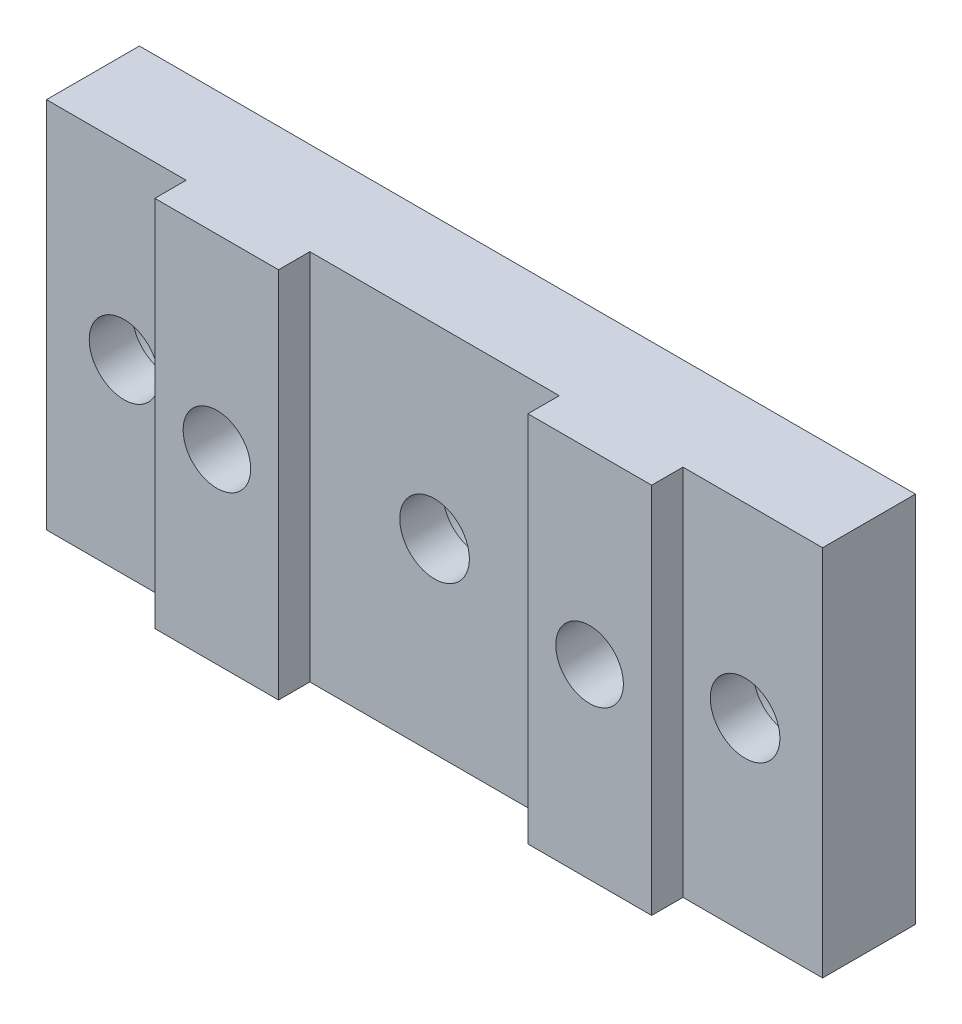
ISO-10303-21;
HEADER;
FILE_DESCRIPTION(('STEP AP214'),'2;1');
FILE_NAME('part.step','',(''),(''),'','','');
FILE_SCHEMA(('AUTOMOTIVE_DESIGN { 1 0 10303 214 1 1 1 1 }'));
ENDSEC;
DATA;
#1=APPLICATION_CONTEXT('core data for automotive mechanical design processes');
#2=APPLICATION_PROTOCOL_DEFINITION('international standard','automotive_design',2000,#1);
#3=PRODUCT_CONTEXT('',#1,'mechanical');
#4=PRODUCT('Part','Part','',(#3));
#5=PRODUCT_RELATED_PRODUCT_CATEGORY('part','',(#4));
#6=PRODUCT_DEFINITION_FORMATION('','',#4);
#7=PRODUCT_DEFINITION_CONTEXT('part definition',#1,'design');
#8=PRODUCT_DEFINITION('design','',#6,#7);
#9=PRODUCT_DEFINITION_SHAPE('','',#8);
#10=(LENGTH_UNIT() NAMED_UNIT(*) SI_UNIT(.MILLI.,.METRE.));
#11=(NAMED_UNIT(*) PLANE_ANGLE_UNIT() SI_UNIT($,.RADIAN.));
#12=(NAMED_UNIT(*) SI_UNIT($,.STERADIAN.) SOLID_ANGLE_UNIT());
#13=UNCERTAINTY_MEASURE_WITH_UNIT(LENGTH_MEASURE(1.E-05),#10,'distance_accuracy_value','');
#14=(GEOMETRIC_REPRESENTATION_CONTEXT(3) GLOBAL_UNCERTAINTY_ASSIGNED_CONTEXT((#13)) GLOBAL_UNIT_ASSIGNED_CONTEXT((#10,
#11,#12)) REPRESENTATION_CONTEXT('',''));
#15=CARTESIAN_POINT('',(0.,0.,0.));
#16=DIRECTION('',(0.,0.,1.));
#17=DIRECTION('',(1.,0.,0.));
#18=AXIS2_PLACEMENT_3D('',#15,#16,#17);
#19=CARTESIAN_POINT('',(0.,19.05,6.35));
#20=DIRECTION('',(0.,0.,-1.));
#21=DIRECTION('',(-1.,0.,0.));
#22=AXIS2_PLACEMENT_3D('',#19,#20,#21);
#23=PLANE('',#22);
#24=CARTESIAN_POINT('',(10.3124,9.525,6.35));
#25=DIRECTION('',(0.,0.,-1.));
#26=DIRECTION('',(-1.,0.,0.));
#27=AXIS2_PLACEMENT_3D('',#24,#25,#26);
#28=CIRCLE('',#27,1.7272);
#29=CARTESIAN_POINT('',(8.5852,9.525,6.35));
#30=VERTEX_POINT('',#29);
#31=EDGE_CURVE('E330',#30,#30,#28,.T.);
#32=ORIENTED_EDGE('',*,*,#31,.T.);
#33=EDGE_LOOP('',(#32));
#34=FACE_BOUND('',#33,.T.);
#35=DIRECTION('',(1.,0.,0.));
#36=VECTOR('',#35,1.);
#37=CARTESIAN_POINT('',(0.,0.,6.35));
#38=LINE('',#37,#36);
#39=CARTESIAN_POINT('',(7.1374,0.,6.35));
#40=VERTEX_POINT('',#39);
#41=CARTESIAN_POINT('',(13.462,0.,6.35));
#42=VERTEX_POINT('',#41);
#43=EDGE_CURVE('E158',#40,#42,#38,.T.);
#44=ORIENTED_EDGE('',*,*,#43,.T.);
#45=DIRECTION('',(0.,-1.,0.));
#46=VECTOR('',#45,1.);
#47=CARTESIAN_POINT('',(13.462,19.05,6.35));
#48=LINE('',#47,#46);
#49=CARTESIAN_POINT('',(13.462,19.05,6.35));
#50=VERTEX_POINT('',#49);
#51=EDGE_CURVE('E225',#50,#42,#48,.T.);
#52=ORIENTED_EDGE('',*,*,#51,.F.);
#53=DIRECTION('',(-1.,0.,0.));
#54=VECTOR('',#53,1.);
#55=CARTESIAN_POINT('',(0.,19.05,6.35));
#56=LINE('',#55,#54);
#57=CARTESIAN_POINT('',(7.1374,19.05,6.35));
#58=VERTEX_POINT('',#57);
#59=EDGE_CURVE('E162',#50,#58,#56,.T.);
#60=ORIENTED_EDGE('',*,*,#59,.T.);
#61=DIRECTION('',(0.,-1.,0.));
#62=VECTOR('',#61,1.);
#63=CARTESIAN_POINT('',(7.1374,19.05,6.35));
#64=LINE('',#63,#62);
#65=EDGE_CURVE('E243',#58,#40,#64,.T.);
#66=ORIENTED_EDGE('',*,*,#65,.T.);
#67=EDGE_LOOP('',(#44,#52,#60,#66));
#68=FACE_BOUND('',#67,.T.);
#69=ADVANCED_FACE('F48',(#34,#68),#23,.F.);
#70=CARTESIAN_POINT('',(0.,0.,6.35));
#71=DIRECTION('',(1.,0.,0.));
#72=DIRECTION('',(0.,0.,-1.));
#73=AXIS2_PLACEMENT_3D('',#70,#71,#72);
#74=PLANE('',#73);
#75=DIRECTION('',(0.,0.,-1.));
#76=VECTOR('',#75,1.);
#77=CARTESIAN_POINT('',(0.,0.,6.35));
#78=LINE('',#77,#76);
#79=CARTESIAN_POINT('',(0.,0.,4.7498));
#80=VERTEX_POINT('',#79);
#81=CARTESIAN_POINT('',(0.,0.,0.));
#82=VERTEX_POINT('',#81);
#83=EDGE_CURVE('E13',#80,#82,#78,.T.);
#84=ORIENTED_EDGE('',*,*,#83,.F.);
#85=DIRECTION('',(0.,-1.,0.));
#86=VECTOR('',#85,1.);
#87=CARTESIAN_POINT('',(0.,19.05,4.7498));
#88=LINE('',#87,#86);
#89=CARTESIAN_POINT('',(0.,19.05,4.7498));
#90=VERTEX_POINT('',#89);
#91=EDGE_CURVE('E242',#90,#80,#88,.T.);
#92=ORIENTED_EDGE('',*,*,#91,.F.);
#93=DIRECTION('',(0.,0.,-1.));
#94=VECTOR('',#93,1.);
#95=CARTESIAN_POINT('',(0.,19.05,6.35));
#96=LINE('',#95,#94);
#97=CARTESIAN_POINT('',(0.,19.05,0.));
#98=VERTEX_POINT('',#97);
#99=EDGE_CURVE('E170',#90,#98,#96,.T.);
#100=ORIENTED_EDGE('',*,*,#99,.T.);
#101=DIRECTION('',(0.,-1.,0.));
#102=VECTOR('',#101,1.);
#103=CARTESIAN_POINT('',(0.,0.,0.));
#104=LINE('',#103,#102);
#105=EDGE_CURVE('E246',#98,#82,#104,.T.);
#106=ORIENTED_EDGE('',*,*,#105,.T.);
#107=EDGE_LOOP('',(#84,#92,#100,#106));
#108=FACE_BOUND('',#107,.T.);
#109=ADVANCED_FACE('F50',(#108),#74,.F.);
#110=CARTESIAN_POINT('',(0.,0.,6.35));
#111=DIRECTION('',(0.,1.,0.));
#112=DIRECTION('',(0.,0.,1.));
#113=AXIS2_PLACEMENT_3D('',#110,#111,#112);
#114=PLANE('',#113);
#115=DIRECTION('',(0.,0.,-1.));
#116=VECTOR('',#115,1.);
#117=CARTESIAN_POINT('',(39.6748,0.,6.35));
#118=LINE('',#117,#116);
#119=CARTESIAN_POINT('',(39.6748,0.,4.7498));
#120=VERTEX_POINT('',#119);
#121=CARTESIAN_POINT('',(39.6748,0.,0.));
#122=VERTEX_POINT('',#121);
#123=EDGE_CURVE('E57',#120,#122,#118,.T.);
#124=ORIENTED_EDGE('',*,*,#123,.F.);
#125=DIRECTION('',(1.,0.,0.));
#126=VECTOR('',#125,1.);
#127=CARTESIAN_POINT('',(39.6748,0.,4.7498));
#128=LINE('',#127,#126);
#129=CARTESIAN_POINT('',(32.5374,0.,4.7498));
#130=VERTEX_POINT('',#129);
#131=EDGE_CURVE('E153',#130,#120,#128,.T.);
#132=ORIENTED_EDGE('',*,*,#131,.F.);
#133=DIRECTION('',(0.,0.,-1.));
#134=VECTOR('',#133,1.);
#135=CARTESIAN_POINT('',(32.5374,0.,6.35));
#136=LINE('',#135,#134);
#137=CARTESIAN_POINT('',(32.5374,0.,6.35));
#138=VERTEX_POINT('',#137);
#139=EDGE_CURVE('E140',#138,#130,#136,.T.);
#140=ORIENTED_EDGE('',*,*,#139,.F.);
#141=CARTESIAN_POINT('',(26.2128,0.,6.35));
#142=VERTEX_POINT('',#141);
#143=EDGE_CURVE('E152',#142,#138,#38,.T.);
#144=ORIENTED_EDGE('',*,*,#143,.F.);
#145=DIRECTION('',(0.,0.,1.));
#146=VECTOR('',#145,1.);
#147=CARTESIAN_POINT('',(26.2128,0.,6.35));
#148=LINE('',#147,#146);
#149=CARTESIAN_POINT('',(26.2128,0.,4.7498));
#150=VERTEX_POINT('',#149);
#151=EDGE_CURVE('E73',#150,#142,#148,.T.);
#152=ORIENTED_EDGE('',*,*,#151,.F.);
#153=DIRECTION('',(1.,0.,0.));
#154=VECTOR('',#153,1.);
#155=CARTESIAN_POINT('',(13.462,0.,4.7498));
#156=LINE('',#155,#154);
#157=CARTESIAN_POINT('',(13.462,0.,4.7498));
#158=VERTEX_POINT('',#157);
#159=EDGE_CURVE('E211',#158,#150,#156,.T.);
#160=ORIENTED_EDGE('',*,*,#159,.F.);
#161=DIRECTION('',(0.,0.,-1.));
#162=VECTOR('',#161,1.);
#163=CARTESIAN_POINT('',(13.462,0.,6.35));
#164=LINE('',#163,#162);
#165=EDGE_CURVE('E207',#42,#158,#164,.T.);
#166=ORIENTED_EDGE('',*,*,#165,.F.);
#167=ORIENTED_EDGE('',*,*,#43,.F.);
#168=DIRECTION('',(0.,0.,1.));
#169=VECTOR('',#168,1.);
#170=CARTESIAN_POINT('',(7.1374,0.,6.35));
#171=LINE('',#170,#169);
#172=CARTESIAN_POINT('',(7.1374,0.,4.7498));
#173=VERTEX_POINT('',#172);
#174=EDGE_CURVE('E234',#173,#40,#171,.T.);
#175=ORIENTED_EDGE('',*,*,#174,.F.);
#176=DIRECTION('',(1.,0.,0.));
#177=VECTOR('',#176,1.);
#178=CARTESIAN_POINT('',(0.,0.,4.7498));
#179=LINE('',#178,#177);
#180=EDGE_CURVE('E227',#80,#173,#179,.T.);
#181=ORIENTED_EDGE('',*,*,#180,.F.);
#182=ORIENTED_EDGE('',*,*,#83,.T.);
#183=DIRECTION('',(1.,0.,0.));
#184=VECTOR('',#183,1.);
#185=CARTESIAN_POINT('',(0.,0.,0.));
#186=LINE('',#185,#184);
#187=EDGE_CURVE('E252',#82,#122,#186,.T.);
#188=ORIENTED_EDGE('',*,*,#187,.T.);
#189=EDGE_LOOP('',(#124,#132,#140,#144,#152,#160,#166,#167,#175,#181,#182,#188));
#190=FACE_BOUND('',#189,.T.);
#191=ADVANCED_FACE('F151',(#190),#114,.F.);
#192=CARTESIAN_POINT('',(39.6748,0.,6.35));
#193=DIRECTION('',(-1.,0.,0.));
#194=DIRECTION('',(0.,0.,1.));
#195=AXIS2_PLACEMENT_3D('',#192,#193,#194);
#196=PLANE('',#195);
#197=DIRECTION('',(0.,0.,-1.));
#198=VECTOR('',#197,1.);
#199=CARTESIAN_POINT('',(39.6748,19.05,6.35));
#200=LINE('',#199,#198);
#201=CARTESIAN_POINT('',(39.6748,19.05,4.7498));
#202=VERTEX_POINT('',#201);
#203=CARTESIAN_POINT('',(39.6748,19.05,0.));
#204=VERTEX_POINT('',#203);
#205=EDGE_CURVE('E172',#202,#204,#200,.T.);
#206=ORIENTED_EDGE('',*,*,#205,.F.);
#207=DIRECTION('',(0.,-1.,0.));
#208=VECTOR('',#207,1.);
#209=CARTESIAN_POINT('',(39.6748,19.05,4.7498));
#210=LINE('',#209,#208);
#211=EDGE_CURVE('E204',#202,#120,#210,.T.);
#212=ORIENTED_EDGE('',*,*,#211,.T.);
#213=ORIENTED_EDGE('',*,*,#123,.T.);
#214=DIRECTION('',(0.,1.,0.));
#215=VECTOR('',#214,1.);
#216=CARTESIAN_POINT('',(39.6748,0.,0.));
#217=LINE('',#216,#215);
#218=EDGE_CURVE('E164',#122,#204,#217,.T.);
#219=ORIENTED_EDGE('',*,*,#218,.T.);
#220=EDGE_LOOP('',(#206,#212,#213,#219));
#221=FACE_BOUND('',#220,.T.);
#222=ADVANCED_FACE('F259',(#221),#196,.F.);
#223=CARTESIAN_POINT('',(0.,19.05,6.35));
#224=DIRECTION('',(0.,-1.,0.));
#225=DIRECTION('',(0.,0.,-1.));
#226=AXIS2_PLACEMENT_3D('',#223,#224,#225);
#227=PLANE('',#226);
#228=DIRECTION('',(0.,0.,-1.));
#229=VECTOR('',#228,1.);
#230=CARTESIAN_POINT('',(32.5374,19.05,6.35));
#231=LINE('',#230,#229);
#232=CARTESIAN_POINT('',(32.5374,19.05,6.35));
#233=VERTEX_POINT('',#232);
#234=CARTESIAN_POINT('',(32.5374,19.05,4.7498));
#235=VERTEX_POINT('',#234);
#236=EDGE_CURVE('E65',#233,#235,#231,.T.);
#237=ORIENTED_EDGE('',*,*,#236,.T.);
#238=DIRECTION('',(1.,0.,0.));
#239=VECTOR('',#238,1.);
#240=CARTESIAN_POINT('',(39.6748,19.05,4.7498));
#241=LINE('',#240,#239);
#242=EDGE_CURVE('E146',#235,#202,#241,.T.);
#243=ORIENTED_EDGE('',*,*,#242,.T.);
#244=ORIENTED_EDGE('',*,*,#205,.T.);
#245=DIRECTION('',(-1.,0.,0.));
#246=VECTOR('',#245,1.);
#247=CARTESIAN_POINT('',(0.,19.05,0.));
#248=LINE('',#247,#246);
#249=EDGE_CURVE('E159',#204,#98,#248,.T.);
#250=ORIENTED_EDGE('',*,*,#249,.T.);
#251=ORIENTED_EDGE('',*,*,#99,.F.);
#252=DIRECTION('',(1.,0.,0.));
#253=VECTOR('',#252,1.);
#254=CARTESIAN_POINT('',(0.,19.05,4.7498));
#255=LINE('',#254,#253);
#256=CARTESIAN_POINT('',(7.1374,19.05,4.7498));
#257=VERTEX_POINT('',#256);
#258=EDGE_CURVE('E236',#90,#257,#255,.T.);
#259=ORIENTED_EDGE('',*,*,#258,.T.);
#260=DIRECTION('',(0.,0.,1.));
#261=VECTOR('',#260,1.);
#262=CARTESIAN_POINT('',(7.1374,19.05,6.35));
#263=LINE('',#262,#261);
#264=EDGE_CURVE('E239',#257,#58,#263,.T.);
#265=ORIENTED_EDGE('',*,*,#264,.T.);
#266=ORIENTED_EDGE('',*,*,#59,.F.);
#267=DIRECTION('',(0.,0.,-1.));
#268=VECTOR('',#267,1.);
#269=CARTESIAN_POINT('',(13.462,19.05,6.35));
#270=LINE('',#269,#268);
#271=CARTESIAN_POINT('',(13.462,19.05,4.7498));
#272=VERTEX_POINT('',#271);
#273=EDGE_CURVE('E215',#50,#272,#270,.T.);
#274=ORIENTED_EDGE('',*,*,#273,.T.);
#275=DIRECTION('',(1.,0.,0.));
#276=VECTOR('',#275,1.);
#277=CARTESIAN_POINT('',(13.462,19.05,4.7498));
#278=LINE('',#277,#276);
#279=CARTESIAN_POINT('',(26.2128,19.05,4.7498));
#280=VERTEX_POINT('',#279);
#281=EDGE_CURVE('E218',#272,#280,#278,.T.);
#282=ORIENTED_EDGE('',*,*,#281,.T.);
#283=DIRECTION('',(0.,0.,1.));
#284=VECTOR('',#283,1.);
#285=CARTESIAN_POINT('',(26.2128,19.05,6.35));
#286=LINE('',#285,#284);
#287=CARTESIAN_POINT('',(26.2128,19.05,6.35));
#288=VERTEX_POINT('',#287);
#289=EDGE_CURVE('E221',#280,#288,#286,.T.);
#290=ORIENTED_EDGE('',*,*,#289,.T.);
#291=EDGE_CURVE('E168',#233,#288,#56,.T.);
#292=ORIENTED_EDGE('',*,*,#291,.F.);
#293=EDGE_LOOP('',(#237,#243,#244,#250,#251,#259,#265,#266,#274,#282,#290,#292));
#294=FACE_BOUND('',#293,.T.);
#295=ADVANCED_FACE('F266',(#294),#227,.F.);
#296=CARTESIAN_POINT('',(29.3624,9.525,6.35));
#297=DIRECTION('',(0.,0.,-1.));
#298=DIRECTION('',(-1.,0.,0.));
#299=AXIS2_PLACEMENT_3D('',#296,#297,#298);
#300=CIRCLE('',#299,1.7272);
#301=CARTESIAN_POINT('',(27.6352,9.525,6.35));
#302=VERTEX_POINT('',#301);
#303=EDGE_CURVE('E321',#302,#302,#300,.T.);
#304=ORIENTED_EDGE('',*,*,#303,.T.);
#305=EDGE_LOOP('',(#304));
#306=FACE_BOUND('',#305,.T.);
#307=ORIENTED_EDGE('',*,*,#143,.T.);
#308=DIRECTION('',(0.,-1.,0.));
#309=VECTOR('',#308,1.);
#310=CARTESIAN_POINT('',(32.5374,19.05,6.35));
#311=LINE('',#310,#309);
#312=EDGE_CURVE('E137',#233,#138,#311,.T.);
#313=ORIENTED_EDGE('',*,*,#312,.F.);
#314=ORIENTED_EDGE('',*,*,#291,.T.);
#315=DIRECTION('',(0.,-1.,0.));
#316=VECTOR('',#315,1.);
#317=CARTESIAN_POINT('',(26.2128,19.05,6.35));
#318=LINE('',#317,#316);
#319=EDGE_CURVE('E157',#288,#142,#318,.T.);
#320=ORIENTED_EDGE('',*,*,#319,.T.);
#321=EDGE_LOOP('',(#307,#313,#314,#320));
#322=FACE_BOUND('',#321,.T.);
#323=ADVANCED_FACE('F156',(#306,#322),#23,.F.);
#324=CARTESIAN_POINT('',(0.,19.05,0.));
#325=DIRECTION('',(0.,0.,-1.));
#326=DIRECTION('',(-1.,0.,0.));
#327=AXIS2_PLACEMENT_3D('',#324,#325,#326);
#328=PLANE('',#327);
#329=CARTESIAN_POINT('',(10.3124,9.525,0.));
#330=DIRECTION('',(0.,0.,-1.));
#331=DIRECTION('',(-1.,0.,0.));
#332=AXIS2_PLACEMENT_3D('',#329,#330,#331);
#333=CIRCLE('',#332,1.72719999999999);
#334=CARTESIAN_POINT('',(8.58520000000001,9.525,0.));
#335=VERTEX_POINT('',#334);
#336=EDGE_CURVE('E324',#335,#335,#333,.T.);
#337=ORIENTED_EDGE('',*,*,#336,.F.);
#338=EDGE_LOOP('',(#337));
#339=FACE_BOUND('',#338,.T.);
#340=CARTESIAN_POINT('',(29.3624,9.525,0.));
#341=DIRECTION('',(0.,0.,-1.));
#342=DIRECTION('',(-1.,0.,0.));
#343=AXIS2_PLACEMENT_3D('',#340,#341,#342);
#344=CIRCLE('',#343,1.72719999999999);
#345=CARTESIAN_POINT('',(27.6352,9.525,0.));
#346=VERTEX_POINT('',#345);
#347=EDGE_CURVE('E323',#346,#346,#344,.T.);
#348=ORIENTED_EDGE('',*,*,#347,.F.);
#349=EDGE_LOOP('',(#348));
#350=FACE_BOUND('',#349,.T.);
#351=CARTESIAN_POINT('',(3.9624,9.525,0.));
#352=DIRECTION('',(0.,0.,-1.));
#353=DIRECTION('',(-1.,0.,0.));
#354=AXIS2_PLACEMENT_3D('',#351,#352,#353);
#355=CIRCLE('',#354,3.17500000000001);
#356=CARTESIAN_POINT('',(0.787399999999985,9.525,0.));
#357=VERTEX_POINT('',#356);
#358=EDGE_CURVE('E327',#357,#357,#355,.T.);
#359=ORIENTED_EDGE('',*,*,#358,.F.);
#360=EDGE_LOOP('',(#359));
#361=FACE_BOUND('',#360,.T.);
#362=CARTESIAN_POINT('',(19.8374,9.525,0.));
#363=DIRECTION('',(0.,0.,-1.));
#364=DIRECTION('',(-1.,0.,0.));
#365=AXIS2_PLACEMENT_3D('',#362,#363,#364);
#366=CIRCLE('',#365,3.17500000000001);
#367=CARTESIAN_POINT('',(16.6624,9.525,0.));
#368=VERTEX_POINT('',#367);
#369=EDGE_CURVE('E192',#368,#368,#366,.T.);
#370=ORIENTED_EDGE('',*,*,#369,.F.);
#371=EDGE_LOOP('',(#370));
#372=FACE_BOUND('',#371,.T.);
#373=CARTESIAN_POINT('',(35.7124,9.525,0.));
#374=DIRECTION('',(0.,0.,-1.));
#375=DIRECTION('',(-1.,0.,0.));
#376=AXIS2_PLACEMENT_3D('',#373,#374,#375);
#377=CIRCLE('',#376,3.17500000000002);
#378=CARTESIAN_POINT('',(32.5374,9.525,0.));
#379=VERTEX_POINT('',#378);
#380=EDGE_CURVE('E179',#379,#379,#377,.T.);
#381=ORIENTED_EDGE('',*,*,#380,.F.);
#382=EDGE_LOOP('',(#381));
#383=FACE_BOUND('',#382,.T.);
#384=ORIENTED_EDGE('',*,*,#105,.F.);
#385=ORIENTED_EDGE('',*,*,#249,.F.);
#386=ORIENTED_EDGE('',*,*,#218,.F.);
#387=ORIENTED_EDGE('',*,*,#187,.F.);
#388=EDGE_LOOP('',(#384,#385,#386,#387));
#389=FACE_BOUND('',#388,.T.);
#390=ADVANCED_FACE('F263',(#339,#350,#361,#372,#383,#389),#328,.T.);
#391=CARTESIAN_POINT('',(7.1374,19.05,6.35));
#392=DIRECTION('',(1.,0.,0.));
#393=DIRECTION('',(0.,0.,-1.));
#394=AXIS2_PLACEMENT_3D('',#391,#392,#393);
#395=PLANE('',#394);
#396=ORIENTED_EDGE('',*,*,#174,.T.);
#397=ORIENTED_EDGE('',*,*,#65,.F.);
#398=ORIENTED_EDGE('',*,*,#264,.F.);
#399=DIRECTION('',(0.,-1.,0.));
#400=VECTOR('',#399,1.);
#401=CARTESIAN_POINT('',(7.1374,19.05,4.7498));
#402=LINE('',#401,#400);
#403=EDGE_CURVE('E247',#257,#173,#402,.T.);
#404=ORIENTED_EDGE('',*,*,#403,.T.);
#405=EDGE_LOOP('',(#396,#397,#398,#404));
#406=FACE_BOUND('',#405,.T.);
#407=ADVANCED_FACE('F281',(#406),#395,.F.);
#408=CARTESIAN_POINT('',(0.,19.05,4.7498));
#409=DIRECTION('',(0.,0.,-1.));
#410=DIRECTION('',(-1.,0.,0.));
#411=AXIS2_PLACEMENT_3D('',#408,#409,#410);
#412=PLANE('',#411);
#413=CARTESIAN_POINT('',(3.9624,9.525,4.7498));
#414=DIRECTION('',(0.,0.,-1.));
#415=DIRECTION('',(-1.,0.,0.));
#416=AXIS2_PLACEMENT_3D('',#413,#414,#415);
#417=CIRCLE('',#416,1.77800000000001);
#418=CARTESIAN_POINT('',(2.18439999999999,9.525,4.7498));
#419=VERTEX_POINT('',#418);
#420=EDGE_CURVE('E52',#419,#419,#417,.T.);
#421=ORIENTED_EDGE('',*,*,#420,.T.);
#422=EDGE_LOOP('',(#421));
#423=FACE_BOUND('',#422,.T.);
#424=ORIENTED_EDGE('',*,*,#180,.T.);
#425=ORIENTED_EDGE('',*,*,#403,.F.);
#426=ORIENTED_EDGE('',*,*,#258,.F.);
#427=ORIENTED_EDGE('',*,*,#91,.T.);
#428=EDGE_LOOP('',(#424,#425,#426,#427));
#429=FACE_BOUND('',#428,.T.);
#430=ADVANCED_FACE('F275',(#423,#429),#412,.F.);
#431=CARTESIAN_POINT('',(13.462,19.05,6.35));
#432=DIRECTION('',(-1.,0.,0.));
#433=DIRECTION('',(0.,0.,1.));
#434=AXIS2_PLACEMENT_3D('',#431,#432,#433);
#435=PLANE('',#434);
#436=ORIENTED_EDGE('',*,*,#165,.T.);
#437=DIRECTION('',(0.,-1.,0.));
#438=VECTOR('',#437,1.);
#439=CARTESIAN_POINT('',(13.462,19.05,4.7498));
#440=LINE('',#439,#438);
#441=EDGE_CURVE('E224',#272,#158,#440,.T.);
#442=ORIENTED_EDGE('',*,*,#441,.F.);
#443=ORIENTED_EDGE('',*,*,#273,.F.);
#444=ORIENTED_EDGE('',*,*,#51,.T.);
#445=EDGE_LOOP('',(#436,#442,#443,#444));
#446=FACE_BOUND('',#445,.T.);
#447=ADVANCED_FACE('F288',(#446),#435,.F.);
#448=CARTESIAN_POINT('',(26.2128,19.05,6.35));
#449=DIRECTION('',(1.,0.,0.));
#450=DIRECTION('',(0.,0.,-1.));
#451=AXIS2_PLACEMENT_3D('',#448,#449,#450);
#452=PLANE('',#451);
#453=ORIENTED_EDGE('',*,*,#151,.T.);
#454=ORIENTED_EDGE('',*,*,#319,.F.);
#455=ORIENTED_EDGE('',*,*,#289,.F.);
#456=DIRECTION('',(0.,-1.,0.));
#457=VECTOR('',#456,1.);
#458=CARTESIAN_POINT('',(26.2128,19.05,4.7498));
#459=LINE('',#458,#457);
#460=EDGE_CURVE('E229',#280,#150,#459,.T.);
#461=ORIENTED_EDGE('',*,*,#460,.T.);
#462=EDGE_LOOP('',(#453,#454,#455,#461));
#463=FACE_BOUND('',#462,.T.);
#464=ADVANCED_FACE('F293',(#463),#452,.F.);
#465=CARTESIAN_POINT('',(13.462,19.05,4.7498));
#466=DIRECTION('',(0.,0.,-1.));
#467=DIRECTION('',(-1.,0.,0.));
#468=AXIS2_PLACEMENT_3D('',#465,#466,#467);
#469=PLANE('',#468);
#470=CARTESIAN_POINT('',(19.8374,9.525,4.7498));
#471=DIRECTION('',(0.,0.,-1.));
#472=DIRECTION('',(-1.,0.,0.));
#473=AXIS2_PLACEMENT_3D('',#470,#471,#472);
#474=CIRCLE('',#473,1.77800000000001);
#475=CARTESIAN_POINT('',(18.0594,9.525,4.7498));
#476=VERTEX_POINT('',#475);
#477=EDGE_CURVE('E177',#476,#476,#474,.T.);
#478=ORIENTED_EDGE('',*,*,#477,.T.);
#479=EDGE_LOOP('',(#478));
#480=FACE_BOUND('',#479,.T.);
#481=ORIENTED_EDGE('',*,*,#159,.T.);
#482=ORIENTED_EDGE('',*,*,#460,.F.);
#483=ORIENTED_EDGE('',*,*,#281,.F.);
#484=ORIENTED_EDGE('',*,*,#441,.T.);
#485=EDGE_LOOP('',(#481,#482,#483,#484));
#486=FACE_BOUND('',#485,.T.);
#487=ADVANCED_FACE('F291',(#480,#486),#469,.F.);
#488=CARTESIAN_POINT('',(39.6748,19.05,4.7498));
#489=DIRECTION('',(0.,0.,-1.));
#490=DIRECTION('',(-1.,0.,0.));
#491=AXIS2_PLACEMENT_3D('',#488,#489,#490);
#492=PLANE('',#491);
#493=CARTESIAN_POINT('',(35.7124,9.525,4.7498));
#494=DIRECTION('',(0.,0.,-1.));
#495=DIRECTION('',(-1.,0.,0.));
#496=AXIS2_PLACEMENT_3D('',#493,#494,#495);
#497=CIRCLE('',#496,1.77800000000001);
#498=CARTESIAN_POINT('',(33.9344,9.525,4.7498));
#499=VERTEX_POINT('',#498);
#500=EDGE_CURVE('E154',#499,#499,#497,.T.);
#501=ORIENTED_EDGE('',*,*,#500,.T.);
#502=EDGE_LOOP('',(#501));
#503=FACE_BOUND('',#502,.T.);
#504=ORIENTED_EDGE('',*,*,#131,.T.);
#505=ORIENTED_EDGE('',*,*,#211,.F.);
#506=ORIENTED_EDGE('',*,*,#242,.F.);
#507=DIRECTION('',(0.,-1.,0.));
#508=VECTOR('',#507,1.);
#509=CARTESIAN_POINT('',(32.5374,19.05,4.7498));
#510=LINE('',#509,#508);
#511=EDGE_CURVE('E145',#235,#130,#510,.T.);
#512=ORIENTED_EDGE('',*,*,#511,.T.);
#513=EDGE_LOOP('',(#504,#505,#506,#512));
#514=FACE_BOUND('',#513,.T.);
#515=ADVANCED_FACE('F269',(#503,#514),#492,.F.);
#516=CARTESIAN_POINT('',(32.5374,19.05,6.35));
#517=DIRECTION('',(-1.,0.,0.));
#518=DIRECTION('',(0.,0.,1.));
#519=AXIS2_PLACEMENT_3D('',#516,#517,#518);
#520=PLANE('',#519);
#521=ORIENTED_EDGE('',*,*,#139,.T.);
#522=ORIENTED_EDGE('',*,*,#511,.F.);
#523=ORIENTED_EDGE('',*,*,#236,.F.);
#524=ORIENTED_EDGE('',*,*,#312,.T.);
#525=EDGE_LOOP('',(#521,#522,#523,#524));
#526=FACE_BOUND('',#525,.T.);
#527=ADVANCED_FACE('F139',(#526),#520,.F.);
#528=CARTESIAN_POINT('',(35.7124,9.525,0.));
#529=DIRECTION('',(0.,0.,-1.));
#530=DIRECTION('',(-1.,0.,0.));
#531=AXIS2_PLACEMENT_3D('',#528,#529,#530);
#532=CYLINDRICAL_SURFACE('',#531,1.77800000000001);
#533=CARTESIAN_POINT('',(35.7124,9.525,2.54));
#534=DIRECTION('',(0.,0.,-1.));
#535=DIRECTION('',(-1.,0.,0.));
#536=AXIS2_PLACEMENT_3D('',#533,#534,#535);
#537=CIRCLE('',#536,1.77800000000002);
#538=CARTESIAN_POINT('',(33.9344,9.525,2.54));
#539=VERTEX_POINT('',#538);
#540=EDGE_CURVE('E176',#539,#539,#537,.T.);
#541=ORIENTED_EDGE('',*,*,#540,.T.);
#542=EDGE_LOOP('',(#541));
#543=FACE_BOUND('',#542,.T.);
#544=ORIENTED_EDGE('',*,*,#500,.F.);
#545=EDGE_LOOP('',(#544));
#546=FACE_BOUND('',#545,.T.);
#547=ADVANCED_FACE('F379',(#543,#546),#532,.F.);
#548=CARTESIAN_POINT('',(37.4904,9.525,2.54));
#549=DIRECTION('',(0.,0.,1.));
#550=DIRECTION('',(1.,0.,0.));
#551=AXIS2_PLACEMENT_3D('',#548,#549,#550);
#552=PLANE('',#551);
#553=ORIENTED_EDGE('',*,*,#540,.F.);
#554=EDGE_LOOP('',(#553));
#555=FACE_BOUND('',#554,.T.);
#556=CARTESIAN_POINT('',(35.7124,9.525,2.54));
#557=DIRECTION('',(0.,0.,-1.));
#558=DIRECTION('',(-1.,0.,0.));
#559=AXIS2_PLACEMENT_3D('',#556,#557,#558);
#560=CIRCLE('',#559,3.17500000000001);
#561=CARTESIAN_POINT('',(32.5374,9.525,2.54));
#562=VERTEX_POINT('',#561);
#563=EDGE_CURVE('E184',#562,#562,#560,.T.);
#564=ORIENTED_EDGE('',*,*,#563,.T.);
#565=EDGE_LOOP('',(#564));
#566=FACE_BOUND('',#565,.T.);
#567=ADVANCED_FACE('F375',(#555,#566),#552,.F.);
#568=CARTESIAN_POINT('',(35.7124,9.525,0.));
#569=DIRECTION('',(0.,0.,-1.));
#570=DIRECTION('',(-1.,0.,0.));
#571=AXIS2_PLACEMENT_3D('',#568,#569,#570);
#572=CYLINDRICAL_SURFACE('',#571,3.17500000000001);
#573=ORIENTED_EDGE('',*,*,#563,.F.);
#574=EDGE_LOOP('',(#573));
#575=FACE_BOUND('',#574,.T.);
#576=ORIENTED_EDGE('',*,*,#380,.T.);
#577=EDGE_LOOP('',(#576));
#578=FACE_BOUND('',#577,.T.);
#579=ADVANCED_FACE('F372',(#575,#578),#572,.F.);
#580=CARTESIAN_POINT('',(19.8374,9.525,0.));
#581=DIRECTION('',(0.,0.,-1.));
#582=DIRECTION('',(-1.,0.,0.));
#583=AXIS2_PLACEMENT_3D('',#580,#581,#582);
#584=CYLINDRICAL_SURFACE('',#583,1.77800000000001);
#585=CARTESIAN_POINT('',(19.8374,9.525,2.54));
#586=DIRECTION('',(0.,0.,-1.));
#587=DIRECTION('',(-1.,0.,0.));
#588=AXIS2_PLACEMENT_3D('',#585,#586,#587);
#589=CIRCLE('',#588,1.77800000000001);
#590=CARTESIAN_POINT('',(18.0594,9.525,2.54));
#591=VERTEX_POINT('',#590);
#592=EDGE_CURVE('E180',#591,#591,#589,.T.);
#593=ORIENTED_EDGE('',*,*,#592,.T.);
#594=EDGE_LOOP('',(#593));
#595=FACE_BOUND('',#594,.T.);
#596=ORIENTED_EDGE('',*,*,#477,.F.);
#597=EDGE_LOOP('',(#596));
#598=FACE_BOUND('',#597,.T.);
#599=ADVANCED_FACE('F368',(#595,#598),#584,.F.);
#600=CARTESIAN_POINT('',(21.6154,9.525,2.54));
#601=DIRECTION('',(0.,0.,1.));
#602=DIRECTION('',(1.,0.,0.));
#603=AXIS2_PLACEMENT_3D('',#600,#601,#602);
#604=PLANE('',#603);
#605=ORIENTED_EDGE('',*,*,#592,.F.);
#606=EDGE_LOOP('',(#605));
#607=FACE_BOUND('',#606,.T.);
#608=CARTESIAN_POINT('',(19.8374,9.525,2.54));
#609=DIRECTION('',(0.,0.,-1.));
#610=DIRECTION('',(-1.,0.,0.));
#611=AXIS2_PLACEMENT_3D('',#608,#609,#610);
#612=CIRCLE('',#611,3.17500000000001);
#613=CARTESIAN_POINT('',(16.6624,9.525,2.54));
#614=VERTEX_POINT('',#613);
#615=EDGE_CURVE('E187',#614,#614,#612,.T.);
#616=ORIENTED_EDGE('',*,*,#615,.T.);
#617=EDGE_LOOP('',(#616));
#618=FACE_BOUND('',#617,.T.);
#619=ADVANCED_FACE('F361',(#607,#618),#604,.F.);
#620=CARTESIAN_POINT('',(19.8374,9.525,0.));
#621=DIRECTION('',(0.,0.,-1.));
#622=DIRECTION('',(-1.,0.,0.));
#623=AXIS2_PLACEMENT_3D('',#620,#621,#622);
#624=CYLINDRICAL_SURFACE('',#623,3.17500000000001);
#625=ORIENTED_EDGE('',*,*,#615,.F.);
#626=EDGE_LOOP('',(#625));
#627=FACE_BOUND('',#626,.T.);
#628=ORIENTED_EDGE('',*,*,#369,.T.);
#629=EDGE_LOOP('',(#628));
#630=FACE_BOUND('',#629,.T.);
#631=ADVANCED_FACE('F351',(#627,#630),#624,.F.);
#632=CARTESIAN_POINT('',(3.9624,9.525,0.));
#633=DIRECTION('',(0.,0.,-1.));
#634=DIRECTION('',(-1.,0.,0.));
#635=AXIS2_PLACEMENT_3D('',#632,#633,#634);
#636=CYLINDRICAL_SURFACE('',#635,1.77800000000001);
#637=CARTESIAN_POINT('',(3.9624,9.525,2.54));
#638=DIRECTION('',(0.,0.,-1.));
#639=DIRECTION('',(-1.,0.,0.));
#640=AXIS2_PLACEMENT_3D('',#637,#638,#639);
#641=CIRCLE('',#640,1.77800000000001);
#642=CARTESIAN_POINT('',(2.18439999999999,9.525,2.54));
#643=VERTEX_POINT('',#642);
#644=EDGE_CURVE('E339',#643,#643,#641,.T.);
#645=ORIENTED_EDGE('',*,*,#644,.T.);
#646=EDGE_LOOP('',(#645));
#647=FACE_BOUND('',#646,.T.);
#648=ORIENTED_EDGE('',*,*,#420,.F.);
#649=EDGE_LOOP('',(#648));
#650=FACE_BOUND('',#649,.T.);
#651=ADVANCED_FACE('F348',(#647,#650),#636,.F.);
#652=CARTESIAN_POINT('',(5.74040000000001,9.525,2.54));
#653=DIRECTION('',(0.,0.,1.));
#654=DIRECTION('',(1.,0.,0.));
#655=AXIS2_PLACEMENT_3D('',#652,#653,#654);
#656=PLANE('',#655);
#657=ORIENTED_EDGE('',*,*,#644,.F.);
#658=EDGE_LOOP('',(#657));
#659=FACE_BOUND('',#658,.T.);
#660=CARTESIAN_POINT('',(3.9624,9.525,2.54));
#661=DIRECTION('',(0.,0.,-1.));
#662=DIRECTION('',(-1.,0.,0.));
#663=AXIS2_PLACEMENT_3D('',#660,#661,#662);
#664=CIRCLE('',#663,3.17500000000001);
#665=CARTESIAN_POINT('',(0.787399999999991,9.525,2.54));
#666=VERTEX_POINT('',#665);
#667=EDGE_CURVE('E336',#666,#666,#664,.T.);
#668=ORIENTED_EDGE('',*,*,#667,.T.);
#669=EDGE_LOOP('',(#668));
#670=FACE_BOUND('',#669,.T.);
#671=ADVANCED_FACE('F350',(#659,#670),#656,.F.);
#672=CARTESIAN_POINT('',(3.9624,9.525,0.));
#673=DIRECTION('',(0.,0.,-1.));
#674=DIRECTION('',(-1.,0.,0.));
#675=AXIS2_PLACEMENT_3D('',#672,#673,#674);
#676=CYLINDRICAL_SURFACE('',#675,3.17500000000001);
#677=ORIENTED_EDGE('',*,*,#667,.F.);
#678=EDGE_LOOP('',(#677));
#679=FACE_BOUND('',#678,.T.);
#680=ORIENTED_EDGE('',*,*,#358,.T.);
#681=EDGE_LOOP('',(#680));
#682=FACE_BOUND('',#681,.T.);
#683=ADVANCED_FACE('F358',(#679,#682),#676,.F.);
#684=CARTESIAN_POINT('',(29.3624,9.525,0.));
#685=DIRECTION('',(0.,0.,-1.));
#686=DIRECTION('',(-1.,0.,0.));
#687=AXIS2_PLACEMENT_3D('',#684,#685,#686);
#688=CYLINDRICAL_SURFACE('',#687,1.72719999999999);
#689=ORIENTED_EDGE('',*,*,#303,.F.);
#690=EDGE_LOOP('',(#689));
#691=FACE_BOUND('',#690,.T.);
#692=ORIENTED_EDGE('',*,*,#347,.T.);
#693=EDGE_LOOP('',(#692));
#694=FACE_BOUND('',#693,.T.);
#695=ADVANCED_FACE('F434',(#691,#694),#688,.F.);
#696=CARTESIAN_POINT('',(10.3124,9.525,0.));
#697=DIRECTION('',(0.,0.,-1.));
#698=DIRECTION('',(-1.,0.,0.));
#699=AXIS2_PLACEMENT_3D('',#696,#697,#698);
#700=CYLINDRICAL_SURFACE('',#699,1.72719999999999);
#701=ORIENTED_EDGE('',*,*,#31,.F.);
#702=EDGE_LOOP('',(#701));
#703=FACE_BOUND('',#702,.T.);
#704=ORIENTED_EDGE('',*,*,#336,.T.);
#705=EDGE_LOOP('',(#704));
#706=FACE_BOUND('',#705,.T.);
#707=ADVANCED_FACE('F444',(#703,#706),#700,.F.);
#708=CLOSED_SHELL('',(#69,#109,#191,#222,#295,#323,#390,#407,#430,#447,#464,#487,#515,#527,#547,
#567,#579,#599,#619,#631,#651,#671,#683,#695,#707));
#709=MANIFOLD_SOLID_BREP('B2',#708);
#710=ADVANCED_BREP_SHAPE_REPRESENTATION('',(#18,#709),#14);
#711=SHAPE_DEFINITION_REPRESENTATION(#9,#710);
ENDSEC;
END-ISO-10303-21;
